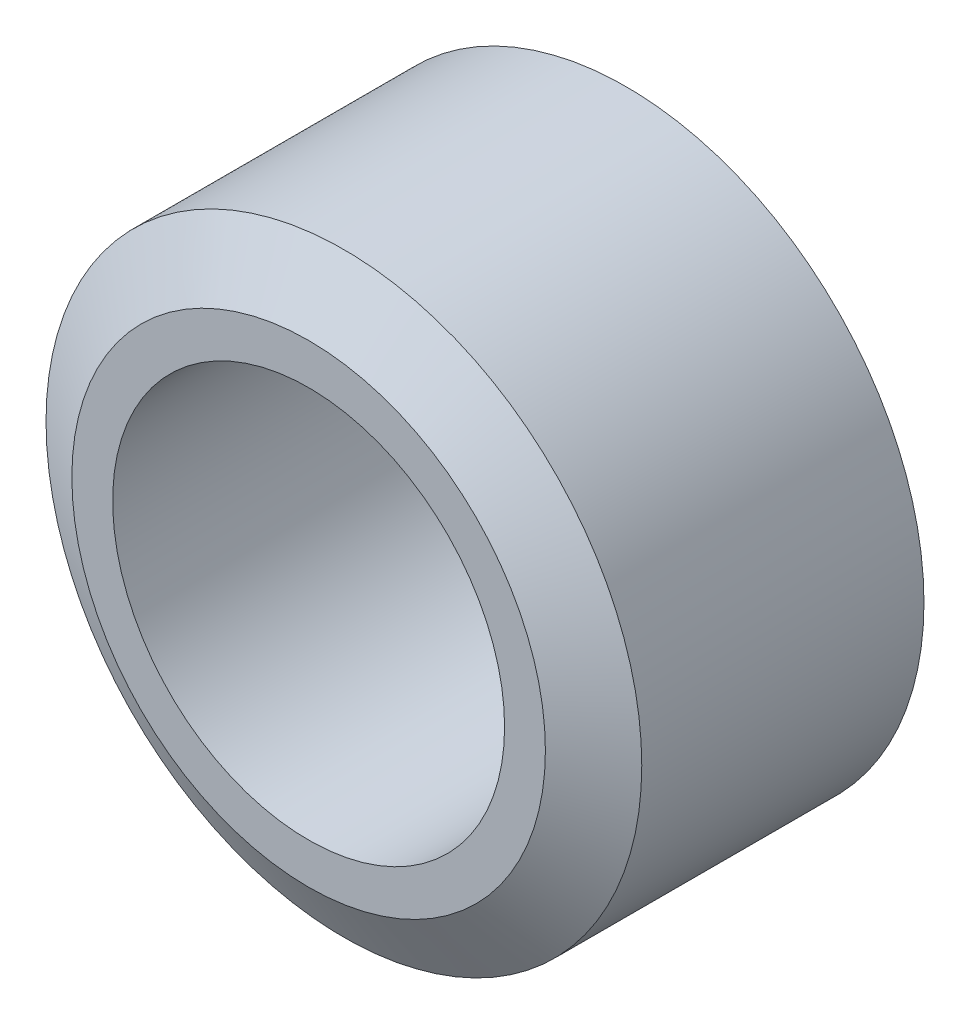
ISO-10303-21;
HEADER;
FILE_DESCRIPTION(('STEP AP214'),'2;1');
FILE_NAME('part.step','',(''),(''),'','','');
FILE_SCHEMA(('AUTOMOTIVE_DESIGN { 1 0 10303 214 1 1 1 1 }'));
ENDSEC;
DATA;
#1=APPLICATION_CONTEXT('core data for automotive mechanical design processes');
#2=APPLICATION_PROTOCOL_DEFINITION('international standard','automotive_design',2000,#1);
#3=PRODUCT_CONTEXT('',#1,'mechanical');
#4=PRODUCT('Part','Part','',(#3));
#5=PRODUCT_RELATED_PRODUCT_CATEGORY('part','',(#4));
#6=PRODUCT_DEFINITION_FORMATION('','',#4);
#7=PRODUCT_DEFINITION_CONTEXT('part definition',#1,'design');
#8=PRODUCT_DEFINITION('design','',#6,#7);
#9=PRODUCT_DEFINITION_SHAPE('','',#8);
#10=(LENGTH_UNIT() NAMED_UNIT(*) SI_UNIT(.MILLI.,.METRE.));
#11=(NAMED_UNIT(*) PLANE_ANGLE_UNIT() SI_UNIT($,.RADIAN.));
#12=(NAMED_UNIT(*) SI_UNIT($,.STERADIAN.) SOLID_ANGLE_UNIT());
#13=UNCERTAINTY_MEASURE_WITH_UNIT(LENGTH_MEASURE(1.E-05),#10,'distance_accuracy_value','');
#14=(GEOMETRIC_REPRESENTATION_CONTEXT(3) GLOBAL_UNCERTAINTY_ASSIGNED_CONTEXT((#13)) GLOBAL_UNIT_ASSIGNED_CONTEXT((#10,
#11,#12)) REPRESENTATION_CONTEXT('',''));
#15=CARTESIAN_POINT('',(0.,0.,0.));
#16=DIRECTION('',(0.,0.,1.));
#17=DIRECTION('',(1.,0.,0.));
#18=AXIS2_PLACEMENT_3D('',#15,#16,#17);
#19=CARTESIAN_POINT('',(0.,0.,9.));
#20=DIRECTION('',(0.,0.,1.));
#21=DIRECTION('',(1.,0.,0.));
#22=AXIS2_PLACEMENT_3D('',#19,#20,#21);
#23=PLANE('',#22);
#24=CARTESIAN_POINT('',(0.,0.,9.));
#25=DIRECTION('',(0.,0.,1.));
#26=DIRECTION('',(1.,0.,0.));
#27=AXIS2_PLACEMENT_3D('',#24,#25,#26);
#28=CIRCLE('',#27,6.04115427318802);
#29=CARTESIAN_POINT('',(6.04115427318802,0.,9.));
#30=VERTEX_POINT('',#29);
#31=EDGE_CURVE('E46',#30,#30,#28,.T.);
#32=ORIENTED_EDGE('',*,*,#31,.T.);
#33=EDGE_LOOP('',(#32));
#34=FACE_BOUND('',#33,.T.);
#35=CARTESIAN_POINT('',(0.,0.,9.));
#36=DIRECTION('',(0.,0.,1.));
#37=DIRECTION('',(1.,0.,0.));
#38=AXIS2_PLACEMENT_3D('',#35,#36,#37);
#39=CIRCLE('',#38,5.);
#40=CARTESIAN_POINT('',(5.,0.,9.));
#41=VERTEX_POINT('',#40);
#42=EDGE_CURVE('E51',#41,#41,#39,.T.);
#43=ORIENTED_EDGE('',*,*,#42,.F.);
#44=EDGE_LOOP('',(#43));
#45=FACE_BOUND('',#44,.T.);
#46=ADVANCED_FACE('F31',(#34,#45),#23,.T.);
#47=CARTESIAN_POINT('',(0.,0.,0.));
#48=DIRECTION('',(0.,0.,1.));
#49=DIRECTION('',(1.,0.,0.));
#50=AXIS2_PLACEMENT_3D('',#47,#48,#49);
#51=PLANE('',#50);
#52=CARTESIAN_POINT('',(0.,0.,0.));
#53=DIRECTION('',(0.,0.,1.));
#54=DIRECTION('',(1.,0.,0.));
#55=AXIS2_PLACEMENT_3D('',#52,#53,#54);
#56=CIRCLE('',#55,6.04115427318801);
#57=CARTESIAN_POINT('',(6.04115427318801,0.,0.));
#58=VERTEX_POINT('',#57);
#59=EDGE_CURVE('E10',#58,#58,#56,.F.);
#60=ORIENTED_EDGE('',*,*,#59,.T.);
#61=EDGE_LOOP('',(#60));
#62=FACE_BOUND('',#61,.T.);
#63=CARTESIAN_POINT('',(0.,0.,0.));
#64=DIRECTION('',(0.,0.,1.));
#65=DIRECTION('',(1.,0.,0.));
#66=AXIS2_PLACEMENT_3D('',#63,#64,#65);
#67=CIRCLE('',#66,5.);
#68=CARTESIAN_POINT('',(5.,0.,0.));
#69=VERTEX_POINT('',#68);
#70=EDGE_CURVE('E52',#69,#69,#67,.T.);
#71=ORIENTED_EDGE('',*,*,#70,.T.);
#72=EDGE_LOOP('',(#71));
#73=FACE_BOUND('',#72,.T.);
#74=ADVANCED_FACE('F62',(#62,#73),#51,.F.);
#75=CARTESIAN_POINT('',(0.,0.,9.));
#76=DIRECTION('',(0.,0.,-1.));
#77=DIRECTION('',(-1.,0.,0.));
#78=AXIS2_PLACEMENT_3D('',#75,#76,#77);
#79=CYLINDRICAL_SURFACE('',#78,7.6);
#80=CARTESIAN_POINT('',(0.,0.,0.900000000000001));
#81=DIRECTION('',(0.,0.,1.));
#82=DIRECTION('',(1.,0.,0.));
#83=AXIS2_PLACEMENT_3D('',#80,#81,#82);
#84=CIRCLE('',#83,7.6);
#85=CARTESIAN_POINT('',(7.6,0.,0.900000000000001));
#86=VERTEX_POINT('',#85);
#87=EDGE_CURVE('E38',#86,#86,#84,.T.);
#88=ORIENTED_EDGE('',*,*,#87,.T.);
#89=EDGE_LOOP('',(#88));
#90=FACE_BOUND('',#89,.T.);
#91=CARTESIAN_POINT('',(0.,0.,8.1));
#92=DIRECTION('',(0.,0.,1.));
#93=DIRECTION('',(1.,0.,0.));
#94=AXIS2_PLACEMENT_3D('',#91,#92,#93);
#95=CIRCLE('',#94,7.6);
#96=CARTESIAN_POINT('',(7.6,0.,8.1));
#97=VERTEX_POINT('',#96);
#98=EDGE_CURVE('E42',#97,#97,#95,.F.);
#99=ORIENTED_EDGE('',*,*,#98,.T.);
#100=EDGE_LOOP('',(#99));
#101=FACE_BOUND('',#100,.T.);
#102=ADVANCED_FACE('F68',(#90,#101),#79,.T.);
#103=CARTESIAN_POINT('',(0.,0.,9.));
#104=DIRECTION('',(0.,0.,-1.));
#105=DIRECTION('',(-1.,0.,0.));
#106=AXIS2_PLACEMENT_3D('',#103,#104,#105);
#107=CYLINDRICAL_SURFACE('',#106,5.);
#108=ORIENTED_EDGE('',*,*,#42,.T.);
#109=EDGE_LOOP('',(#108));
#110=FACE_BOUND('',#109,.T.);
#111=ORIENTED_EDGE('',*,*,#70,.F.);
#112=EDGE_LOOP('',(#111));
#113=FACE_BOUND('',#112,.T.);
#114=ADVANCED_FACE('F58',(#110,#113),#107,.F.);
#115=CARTESIAN_POINT('',(0.,0.,9.));
#116=DIRECTION('',(0.,0.,-1.));
#117=DIRECTION('',(-1.,0.,0.));
#118=AXIS2_PLACEMENT_3D('',#115,#116,#117);
#119=CONICAL_SURFACE('',#118,6.04115427318802,1.0471975511966);
#120=ORIENTED_EDGE('',*,*,#98,.F.);
#121=EDGE_LOOP('',(#120));
#122=FACE_BOUND('',#121,.T.);
#123=ORIENTED_EDGE('',*,*,#31,.F.);
#124=EDGE_LOOP('',(#123));
#125=FACE_BOUND('',#124,.T.);
#126=ADVANCED_FACE('F73',(#122,#125),#119,.T.);
#127=CARTESIAN_POINT('',(0.,0.,0.900000000000001));
#128=DIRECTION('',(0.,0.,1.));
#129=DIRECTION('',(1.,0.,0.));
#130=AXIS2_PLACEMENT_3D('',#127,#128,#129);
#131=CONICAL_SURFACE('',#130,7.6,1.0471975511966);
#132=ORIENTED_EDGE('',*,*,#59,.F.);
#133=EDGE_LOOP('',(#132));
#134=FACE_BOUND('',#133,.T.);
#135=ORIENTED_EDGE('',*,*,#87,.F.);
#136=EDGE_LOOP('',(#135));
#137=FACE_BOUND('',#136,.T.);
#138=ADVANCED_FACE('F33',(#134,#137),#131,.T.);
#139=CLOSED_SHELL('',(#46,#74,#102,#114,#126,#138));
#140=MANIFOLD_SOLID_BREP('B2',#139);
#141=ADVANCED_BREP_SHAPE_REPRESENTATION('',(#18,#140),#14);
#142=SHAPE_DEFINITION_REPRESENTATION(#9,#141);
ENDSEC;
END-ISO-10303-21;
